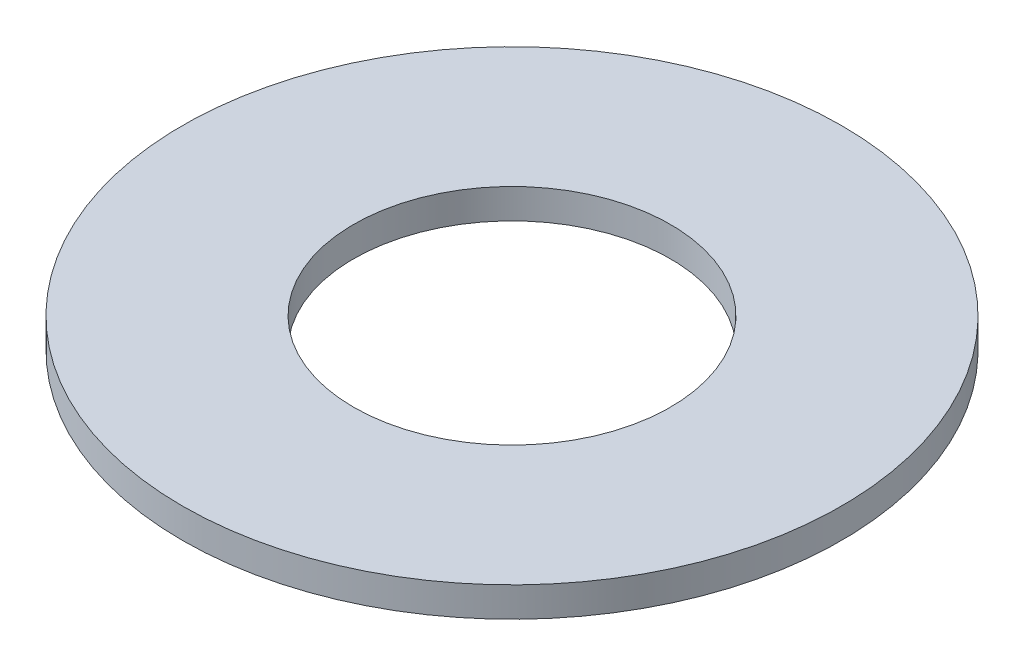
ISO-10303-21;
HEADER;
FILE_DESCRIPTION(('STEP AP214'),'2;1');
FILE_NAME('part.step','',(''),(''),'','','');
FILE_SCHEMA(('AUTOMOTIVE_DESIGN { 1 0 10303 214 1 1 1 1 }'));
ENDSEC;
DATA;
#1=APPLICATION_CONTEXT('core data for automotive mechanical design processes');
#2=APPLICATION_PROTOCOL_DEFINITION('international standard','automotive_design',2000,#1);
#3=PRODUCT_CONTEXT('',#1,'mechanical');
#4=PRODUCT('Part','Part','',(#3));
#5=PRODUCT_RELATED_PRODUCT_CATEGORY('part','',(#4));
#6=PRODUCT_DEFINITION_FORMATION('','',#4);
#7=PRODUCT_DEFINITION_CONTEXT('part definition',#1,'design');
#8=PRODUCT_DEFINITION('design','',#6,#7);
#9=PRODUCT_DEFINITION_SHAPE('','',#8);
#10=(LENGTH_UNIT() NAMED_UNIT(*) SI_UNIT(.MILLI.,.METRE.));
#11=(NAMED_UNIT(*) PLANE_ANGLE_UNIT() SI_UNIT($,.RADIAN.));
#12=(NAMED_UNIT(*) SI_UNIT($,.STERADIAN.) SOLID_ANGLE_UNIT());
#13=UNCERTAINTY_MEASURE_WITH_UNIT(LENGTH_MEASURE(1.E-05),#10,'distance_accuracy_value','');
#14=(GEOMETRIC_REPRESENTATION_CONTEXT(3) GLOBAL_UNCERTAINTY_ASSIGNED_CONTEXT((#13)) GLOBAL_UNIT_ASSIGNED_CONTEXT((#10,
#11,#12)) REPRESENTATION_CONTEXT('',''));
#15=CARTESIAN_POINT('',(0.,0.,0.));
#16=DIRECTION('',(0.,0.,1.));
#17=DIRECTION('',(1.,0.,0.));
#18=AXIS2_PLACEMENT_3D('',#15,#16,#17);
#19=CARTESIAN_POINT('',(0.,3.7338,0.));
#20=DIRECTION('',(0.,-1.,0.));
#21=DIRECTION('',(0.,0.,-1.));
#22=AXIS2_PLACEMENT_3D('',#19,#20,#21);
#23=CYLINDRICAL_SURFACE('',#22,41.275);
#24=CARTESIAN_POINT('',(0.,3.7338,0.));
#25=DIRECTION('',(0.,1.,0.));
#26=DIRECTION('',(0.,0.,1.));
#27=AXIS2_PLACEMENT_3D('',#24,#25,#26);
#28=CIRCLE('',#27,41.275);
#29=CARTESIAN_POINT('',(0.,3.7338,41.275));
#30=VERTEX_POINT('',#29);
#31=EDGE_CURVE('E10',#30,#30,#28,.T.);
#32=ORIENTED_EDGE('',*,*,#31,.F.);
#33=EDGE_LOOP('',(#32));
#34=FACE_BOUND('',#33,.T.);
#35=CARTESIAN_POINT('',(0.,0.,0.));
#36=DIRECTION('',(0.,1.,0.));
#37=DIRECTION('',(0.,0.,1.));
#38=AXIS2_PLACEMENT_3D('',#35,#36,#37);
#39=CIRCLE('',#38,41.275);
#40=CARTESIAN_POINT('',(0.,0.,41.275));
#41=VERTEX_POINT('',#40);
#42=EDGE_CURVE('E35',#41,#41,#39,.T.);
#43=ORIENTED_EDGE('',*,*,#42,.T.);
#44=EDGE_LOOP('',(#43));
#45=FACE_BOUND('',#44,.T.);
#46=ADVANCED_FACE('F32',(#34,#45),#23,.T.);
#47=CARTESIAN_POINT('',(0.,3.7338,0.));
#48=DIRECTION('',(0.,1.,0.));
#49=DIRECTION('',(0.,0.,1.));
#50=AXIS2_PLACEMENT_3D('',#47,#48,#49);
#51=PLANE('',#50);
#52=CARTESIAN_POINT('',(0.,3.7338,0.));
#53=DIRECTION('',(0.,1.,0.));
#54=DIRECTION('',(0.,0.,1.));
#55=AXIS2_PLACEMENT_3D('',#52,#53,#54);
#56=CIRCLE('',#55,19.8374);
#57=CARTESIAN_POINT('',(0.,3.7338,19.8374));
#58=VERTEX_POINT('',#57);
#59=EDGE_CURVE('E44',#58,#58,#56,.T.);
#60=ORIENTED_EDGE('',*,*,#59,.F.);
#61=EDGE_LOOP('',(#60));
#62=FACE_BOUND('',#61,.T.);
#63=ORIENTED_EDGE('',*,*,#31,.T.);
#64=EDGE_LOOP('',(#63));
#65=FACE_BOUND('',#64,.T.);
#66=ADVANCED_FACE('F59',(#62,#65),#51,.T.);
#67=CARTESIAN_POINT('',(0.,0.,0.));
#68=DIRECTION('',(0.,1.,0.));
#69=DIRECTION('',(0.,0.,1.));
#70=AXIS2_PLACEMENT_3D('',#67,#68,#69);
#71=PLANE('',#70);
#72=CARTESIAN_POINT('',(0.,0.,0.));
#73=DIRECTION('',(0.,1.,0.));
#74=DIRECTION('',(0.,0.,1.));
#75=AXIS2_PLACEMENT_3D('',#72,#73,#74);
#76=CIRCLE('',#75,19.8374);
#77=CARTESIAN_POINT('',(0.,0.,19.8374));
#78=VERTEX_POINT('',#77);
#79=EDGE_CURVE('E42',#78,#78,#76,.T.);
#80=ORIENTED_EDGE('',*,*,#79,.T.);
#81=EDGE_LOOP('',(#80));
#82=FACE_BOUND('',#81,.T.);
#83=ORIENTED_EDGE('',*,*,#42,.F.);
#84=EDGE_LOOP('',(#83));
#85=FACE_BOUND('',#84,.T.);
#86=ADVANCED_FACE('F50',(#82,#85),#71,.F.);
#87=CARTESIAN_POINT('',(0.,0.,0.));
#88=DIRECTION('',(0.,1.,0.));
#89=DIRECTION('',(0.,0.,1.));
#90=AXIS2_PLACEMENT_3D('',#87,#88,#89);
#91=CYLINDRICAL_SURFACE('',#90,19.8374);
#92=ORIENTED_EDGE('',*,*,#79,.F.);
#93=EDGE_LOOP('',(#92));
#94=FACE_BOUND('',#93,.T.);
#95=ORIENTED_EDGE('',*,*,#59,.T.);
#96=EDGE_LOOP('',(#95));
#97=FACE_BOUND('',#96,.T.);
#98=ADVANCED_FACE('F53',(#94,#97),#91,.F.);
#99=CLOSED_SHELL('',(#46,#66,#86,#98));
#100=MANIFOLD_SOLID_BREP('B2',#99);
#101=ADVANCED_BREP_SHAPE_REPRESENTATION('',(#18,#100),#14);
#102=SHAPE_DEFINITION_REPRESENTATION(#9,#101);
ENDSEC;
END-ISO-10303-21;
